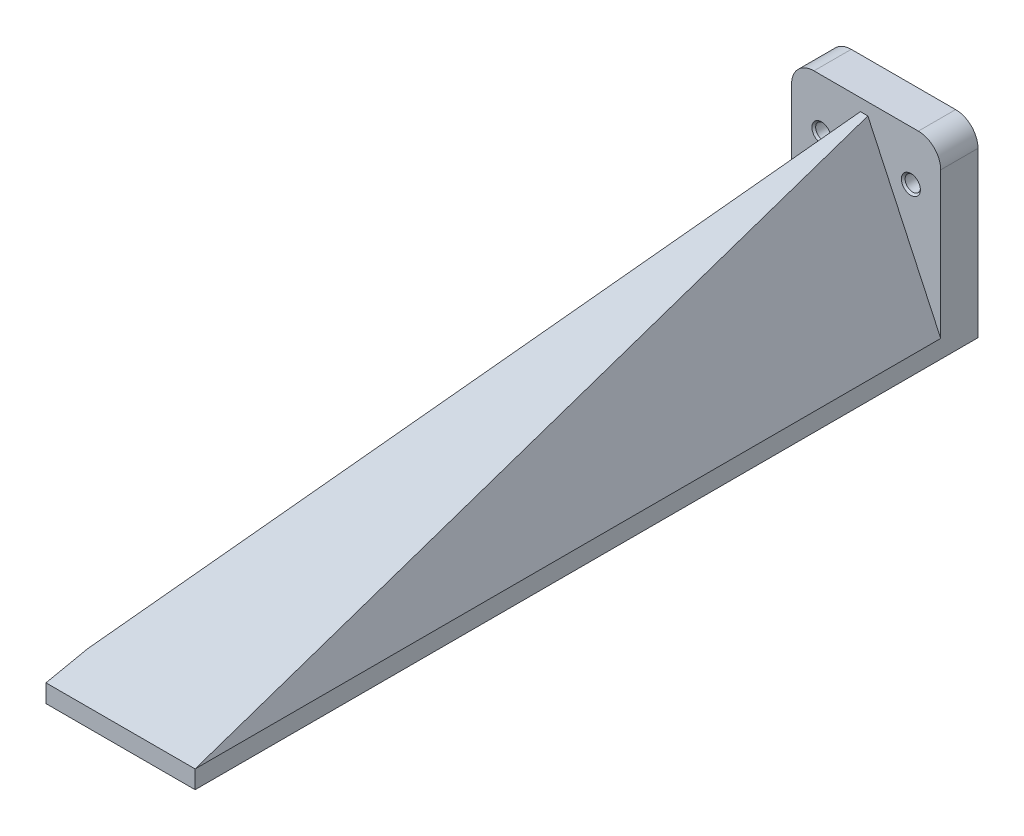
ISO-10303-21;
HEADER;
FILE_DESCRIPTION(('STEP AP214'),'2;1');
FILE_NAME('part.step','',(''),(''),'','','');
FILE_SCHEMA(('AUTOMOTIVE_DESIGN { 1 0 10303 214 1 1 1 1 }'));
ENDSEC;
DATA;
#1=APPLICATION_CONTEXT('core data for automotive mechanical design processes');
#2=APPLICATION_PROTOCOL_DEFINITION('international standard','automotive_design',2000,#1);
#3=PRODUCT_CONTEXT('',#1,'mechanical');
#4=PRODUCT('Part','Part','',(#3));
#5=PRODUCT_RELATED_PRODUCT_CATEGORY('part','',(#4));
#6=PRODUCT_DEFINITION_FORMATION('','',#4);
#7=PRODUCT_DEFINITION_CONTEXT('part definition',#1,'design');
#8=PRODUCT_DEFINITION('design','',#6,#7);
#9=PRODUCT_DEFINITION_SHAPE('','',#8);
#10=(LENGTH_UNIT() NAMED_UNIT(*) SI_UNIT(.MILLI.,.METRE.));
#11=(NAMED_UNIT(*) PLANE_ANGLE_UNIT() SI_UNIT($,.RADIAN.));
#12=(NAMED_UNIT(*) SI_UNIT($,.STERADIAN.) SOLID_ANGLE_UNIT());
#13=UNCERTAINTY_MEASURE_WITH_UNIT(LENGTH_MEASURE(1.E-05),#10,'distance_accuracy_value','');
#14=(GEOMETRIC_REPRESENTATION_CONTEXT(3) GLOBAL_UNCERTAINTY_ASSIGNED_CONTEXT((#13)) GLOBAL_UNIT_ASSIGNED_CONTEXT((#10,
#11,#12)) REPRESENTATION_CONTEXT('',''));
#15=CARTESIAN_POINT('',(0.,0.,0.));
#16=DIRECTION('',(0.,0.,1.));
#17=DIRECTION('',(1.,0.,0.));
#18=AXIS2_PLACEMENT_3D('',#15,#16,#17);
#19=CARTESIAN_POINT('',(0.,0.,5.));
#20=DIRECTION('',(0.,1.,0.));
#21=DIRECTION('',(0.,0.,1.));
#22=AXIS2_PLACEMENT_3D('',#19,#20,#21);
#23=PLANE('',#22);
#24=DIRECTION('',(1.,0.,0.));
#25=VECTOR('',#24,1.);
#26=CARTESIAN_POINT('',(0.,0.,0.));
#27=LINE('',#26,#25);
#28=CARTESIAN_POINT('',(0.,0.,0.));
#29=VERTEX_POINT('',#28);
#30=CARTESIAN_POINT('',(20.,0.,0.));
#31=VERTEX_POINT('',#30);
#32=EDGE_CURVE('E292',#29,#31,#27,.T.);
#33=ORIENTED_EDGE('',*,*,#32,.T.);
#34=DIRECTION('',(0.,0.,-1.));
#35=VECTOR('',#34,1.);
#36=CARTESIAN_POINT('',(20.,0.,5.));
#37=LINE('',#36,#35);
#38=CARTESIAN_POINT('',(20.,0.,105.));
#39=VERTEX_POINT('',#38);
#40=EDGE_CURVE('E289',#39,#31,#37,.T.);
#41=ORIENTED_EDGE('',*,*,#40,.F.);
#42=DIRECTION('',(1.,0.,0.));
#43=VECTOR('',#42,1.);
#44=CARTESIAN_POINT('',(20.,0.,105.));
#45=LINE('',#44,#43);
#46=CARTESIAN_POINT('',(0.,0.,105.));
#47=VERTEX_POINT('',#46);
#48=EDGE_CURVE('E248',#47,#39,#45,.T.);
#49=ORIENTED_EDGE('',*,*,#48,.F.);
#50=DIRECTION('',(0.,0.,-1.));
#51=VECTOR('',#50,1.);
#52=CARTESIAN_POINT('',(0.,0.,5.));
#53=LINE('',#52,#51);
#54=EDGE_CURVE('E304',#47,#29,#53,.T.);
#55=ORIENTED_EDGE('',*,*,#54,.T.);
#56=EDGE_LOOP('',(#33,#41,#49,#55));
#57=FACE_BOUND('',#56,.T.);
#58=DIRECTION('',(1.,0.,0.));
#59=VECTOR('',#58,1.);
#60=CARTESIAN_POINT('',(0.,0.,2.5));
#61=LINE('',#60,#59);
#62=CARTESIAN_POINT('',(2.5,0.,2.5));
#63=VERTEX_POINT('',#62);
#64=CARTESIAN_POINT('',(17.5,0.,2.5));
#65=VERTEX_POINT('',#64);
#66=EDGE_CURVE('E183',#63,#65,#61,.T.);
#67=ORIENTED_EDGE('',*,*,#66,.F.);
#68=DIRECTION('',(0.,0.,-1.));
#69=VECTOR('',#68,1.);
#70=CARTESIAN_POINT('',(2.5,0.,5.));
#71=LINE('',#70,#69);
#72=CARTESIAN_POINT('',(2.5,0.,102.5));
#73=VERTEX_POINT('',#72);
#74=EDGE_CURVE('E180',#73,#63,#71,.T.);
#75=ORIENTED_EDGE('',*,*,#74,.F.);
#76=DIRECTION('',(1.,0.,0.));
#77=VECTOR('',#76,1.);
#78=CARTESIAN_POINT('',(0.,0.,102.5));
#79=LINE('',#78,#77);
#80=CARTESIAN_POINT('',(17.5,0.,102.5));
#81=VERTEX_POINT('',#80);
#82=EDGE_CURVE('E65',#73,#81,#79,.T.);
#83=ORIENTED_EDGE('',*,*,#82,.T.);
#84=DIRECTION('',(0.,0.,-1.));
#85=VECTOR('',#84,1.);
#86=CARTESIAN_POINT('',(17.5,0.,5.));
#87=LINE('',#86,#85);
#88=EDGE_CURVE('E204',#81,#65,#87,.T.);
#89=ORIENTED_EDGE('',*,*,#88,.T.);
#90=EDGE_LOOP('',(#67,#75,#83,#89));
#91=FACE_BOUND('',#90,.T.);
#92=ADVANCED_FACE('F49',(#57,#91),#23,.F.);
#93=CARTESIAN_POINT('',(0.,0.,5.));
#94=DIRECTION('',(0.,0.,-1.));
#95=DIRECTION('',(-1.,0.,0.));
#96=AXIS2_PLACEMENT_3D('',#93,#94,#95);
#97=PLANE('',#96);
#98=CARTESIAN_POINT('',(16.,18.3071806822967,5.));
#99=DIRECTION('',(0.,0.,1.));
#100=DIRECTION('',(1.,0.,0.));
#101=AXIS2_PLACEMENT_3D('',#98,#99,#100);
#102=CIRCLE('',#101,1.275);
#103=CARTESIAN_POINT('',(17.275,18.3071806822967,5.));
#104=VERTEX_POINT('',#103);
#105=EDGE_CURVE('E444',#104,#104,#102,.T.);
#106=ORIENTED_EDGE('',*,*,#105,.F.);
#107=EDGE_LOOP('',(#106));
#108=FACE_BOUND('',#107,.T.);
#109=CARTESIAN_POINT('',(4.,18.3071806822967,5.));
#110=DIRECTION('',(0.,0.,1.));
#111=DIRECTION('',(1.,0.,0.));
#112=AXIS2_PLACEMENT_3D('',#109,#110,#111);
#113=CIRCLE('',#112,1.275);
#114=CARTESIAN_POINT('',(5.275,18.3071806822967,5.));
#115=VERTEX_POINT('',#114);
#116=EDGE_CURVE('E454',#115,#115,#113,.T.);
#117=ORIENTED_EDGE('',*,*,#116,.F.);
#118=EDGE_LOOP('',(#117));
#119=FACE_BOUND('',#118,.T.);
#120=DIRECTION('',(-1.,0.,0.));
#121=VECTOR('',#120,1.);
#122=CARTESIAN_POINT('',(0.,25.,5.));
#123=LINE('',#122,#121);
#124=CARTESIAN_POINT('',(17.,25.,5.));
#125=VERTEX_POINT('',#124);
#126=CARTESIAN_POINT('',(3.,25.,5.));
#127=VERTEX_POINT('',#126);
#128=EDGE_CURVE('E285',#125,#127,#123,.T.);
#129=ORIENTED_EDGE('',*,*,#128,.T.);
#130=CARTESIAN_POINT('',(3.,22.,5.));
#131=DIRECTION('',(0.,0.,-1.));
#132=DIRECTION('',(-1.,0.,0.));
#133=AXIS2_PLACEMENT_3D('',#130,#131,#132);
#134=CIRCLE('',#133,3.);
#135=CARTESIAN_POINT('',(0.,22.,5.));
#136=VERTEX_POINT('',#135);
#137=EDGE_CURVE('E58',#127,#136,#134,.F.);
#138=ORIENTED_EDGE('',*,*,#137,.T.);
#139=DIRECTION('',(0.,-1.,0.));
#140=VECTOR('',#139,1.);
#141=CARTESIAN_POINT('',(0.,0.,5.));
#142=LINE('',#141,#140);
#143=CARTESIAN_POINT('',(0.,3.58738047296451,5.));
#144=VERTEX_POINT('',#143);
#145=EDGE_CURVE('E278',#136,#144,#142,.T.);
#146=ORIENTED_EDGE('',*,*,#145,.T.);
#147=DIRECTION('',(-0.4226182617407,-0.90630778703665,0.));
#148=VECTOR('',#147,1.);
#149=CARTESIAN_POINT('',(0.,3.58738047296451,5.));
#150=LINE('',#149,#148);
#151=CARTESIAN_POINT('',(9.2274155237379,23.3756369220377,4.99999999999998));
#152=VERTEX_POINT('',#151);
#153=EDGE_CURVE('E253',#152,#144,#150,.T.);
#154=ORIENTED_EDGE('',*,*,#153,.F.);
#155=DIRECTION('',(-1.,0.,0.));
#156=VECTOR('',#155,1.);
#157=CARTESIAN_POINT('',(9.22741552373789,23.3756369220377,5.));
#158=LINE('',#157,#156);
#159=CARTESIAN_POINT('',(10.2274155237379,23.3756369220377,5.));
#160=VERTEX_POINT('',#159);
#161=EDGE_CURVE('E264',#160,#152,#158,.T.);
#162=ORIENTED_EDGE('',*,*,#161,.F.);
#163=DIRECTION('',(-0.422618261740701,0.906307787036649,0.));
#164=VECTOR('',#163,1.);
#165=CARTESIAN_POINT('',(10.2274155237379,23.3756369220377,5.));
#166=LINE('',#165,#164);
#167=CARTESIAN_POINT('',(20.,2.41826188142938,5.));
#168=VERTEX_POINT('',#167);
#169=EDGE_CURVE('E247',#168,#160,#166,.T.);
#170=ORIENTED_EDGE('',*,*,#169,.F.);
#171=DIRECTION('',(0.,1.,0.));
#172=VECTOR('',#171,1.);
#173=CARTESIAN_POINT('',(20.,0.,5.));
#174=LINE('',#173,#172);
#175=CARTESIAN_POINT('',(20.,22.,5.));
#176=VERTEX_POINT('',#175);
#177=EDGE_CURVE('E281',#168,#176,#174,.T.);
#178=ORIENTED_EDGE('',*,*,#177,.T.);
#179=CARTESIAN_POINT('',(17.,22.,5.));
#180=DIRECTION('',(0.,0.,-1.));
#181=DIRECTION('',(-1.,0.,0.));
#182=AXIS2_PLACEMENT_3D('',#179,#180,#181);
#183=CIRCLE('',#182,3.);
#184=EDGE_CURVE('E325',#176,#125,#183,.F.);
#185=ORIENTED_EDGE('',*,*,#184,.T.);
#186=EDGE_LOOP('',(#129,#138,#146,#154,#162,#170,#178,#185));
#187=FACE_BOUND('',#186,.T.);
#188=ADVANCED_FACE('F331',(#108,#119,#187),#97,.F.);
#189=CARTESIAN_POINT('',(0.,0.,5.));
#190=DIRECTION('',(1.,0.,0.));
#191=DIRECTION('',(0.,0.,-1.));
#192=AXIS2_PLACEMENT_3D('',#189,#190,#191);
#193=PLANE('',#192);
#194=ORIENTED_EDGE('',*,*,#145,.F.);
#195=DIRECTION('',(0.,0.,-1.));
#196=VECTOR('',#195,1.);
#197=CARTESIAN_POINT('',(0.,22.,5.));
#198=LINE('',#197,#196);
#199=CARTESIAN_POINT('',(0.,22.,0.));
#200=VERTEX_POINT('',#199);
#201=EDGE_CURVE('E308',#136,#200,#198,.T.);
#202=ORIENTED_EDGE('',*,*,#201,.T.);
#203=DIRECTION('',(0.,-1.,0.));
#204=VECTOR('',#203,1.);
#205=CARTESIAN_POINT('',(0.,0.,0.));
#206=LINE('',#205,#204);
#207=EDGE_CURVE('E277',#200,#29,#206,.T.);
#208=ORIENTED_EDGE('',*,*,#207,.T.);
#209=ORIENTED_EDGE('',*,*,#54,.F.);
#210=DIRECTION('',(0.,-1.,0.));
#211=VECTOR('',#210,1.);
#212=CARTESIAN_POINT('',(0.,0.,105.));
#213=LINE('',#212,#211);
#214=CARTESIAN_POINT('',(0.,2.41826188142944,105.));
#215=VERTEX_POINT('',#214);
#216=EDGE_CURVE('E257',#215,#47,#213,.T.);
#217=ORIENTED_EDGE('',*,*,#216,.F.);
#218=DIRECTION('',(0.,0.205117651611007,-0.978737323799182));
#219=VECTOR('',#218,1.);
#220=CARTESIAN_POINT('',(0.,2.41826188142944,105.));
#221=LINE('',#220,#219);
#222=CARTESIAN_POINT('',(0.,3.58738047296451,99.4214454850872));
#223=VERTEX_POINT('',#222);
#224=EDGE_CURVE('E172',#215,#223,#221,.T.);
#225=ORIENTED_EDGE('',*,*,#224,.T.);
#226=DIRECTION('',(0.,0.,-1.));
#227=VECTOR('',#226,1.);
#228=CARTESIAN_POINT('',(0.,3.58738047296451,105.));
#229=LINE('',#228,#227);
#230=EDGE_CURVE('E260',#223,#144,#229,.T.);
#231=ORIENTED_EDGE('',*,*,#230,.T.);
#232=EDGE_LOOP('',(#194,#202,#208,#209,#217,#225,#231));
#233=FACE_BOUND('',#232,.T.);
#234=ADVANCED_FACE('F338',(#233),#193,.F.);
#235=CARTESIAN_POINT('',(20.,0.,5.));
#236=DIRECTION('',(-1.,0.,0.));
#237=DIRECTION('',(0.,0.,1.));
#238=AXIS2_PLACEMENT_3D('',#235,#236,#237);
#239=PLANE('',#238);
#240=DIRECTION('',(0.,1.,0.));
#241=VECTOR('',#240,1.);
#242=CARTESIAN_POINT('',(20.,0.,0.));
#243=LINE('',#242,#241);
#244=CARTESIAN_POINT('',(20.,22.,0.));
#245=VERTEX_POINT('',#244);
#246=EDGE_CURVE('E295',#31,#245,#243,.T.);
#247=ORIENTED_EDGE('',*,*,#246,.T.);
#248=DIRECTION('',(0.,0.,-1.));
#249=VECTOR('',#248,1.);
#250=CARTESIAN_POINT('',(20.,22.,5.));
#251=LINE('',#250,#249);
#252=EDGE_CURVE('E11',#245,#176,#251,.F.);
#253=ORIENTED_EDGE('',*,*,#252,.T.);
#254=ORIENTED_EDGE('',*,*,#177,.F.);
#255=DIRECTION('',(0.,0.,-1.));
#256=VECTOR('',#255,1.);
#257=CARTESIAN_POINT('',(20.,2.41826188142944,105.));
#258=LINE('',#257,#256);
#259=CARTESIAN_POINT('',(20.,2.41826188142944,105.));
#260=VERTEX_POINT('',#259);
#261=EDGE_CURVE('E273',#260,#168,#258,.T.);
#262=ORIENTED_EDGE('',*,*,#261,.F.);
#263=DIRECTION('',(0.,1.,0.));
#264=VECTOR('',#263,1.);
#265=CARTESIAN_POINT('',(20.,2.41826188142944,105.));
#266=LINE('',#265,#264);
#267=EDGE_CURVE('E252',#39,#260,#266,.T.);
#268=ORIENTED_EDGE('',*,*,#267,.F.);
#269=ORIENTED_EDGE('',*,*,#40,.T.);
#270=EDGE_LOOP('',(#247,#253,#254,#262,#268,#269));
#271=FACE_BOUND('',#270,.T.);
#272=ADVANCED_FACE('F352',(#271),#239,.F.);
#273=CARTESIAN_POINT('',(0.,25.,5.));
#274=DIRECTION('',(0.,-1.,0.));
#275=DIRECTION('',(0.,0.,-1.));
#276=AXIS2_PLACEMENT_3D('',#273,#274,#275);
#277=PLANE('',#276);
#278=DIRECTION('',(-1.,0.,0.));
#279=VECTOR('',#278,1.);
#280=CARTESIAN_POINT('',(0.,25.,0.));
#281=LINE('',#280,#279);
#282=CARTESIAN_POINT('',(17.,25.,0.));
#283=VERTEX_POINT('',#282);
#284=CARTESIAN_POINT('',(3.,25.,0.));
#285=VERTEX_POINT('',#284);
#286=EDGE_CURVE('E282',#283,#285,#281,.T.);
#287=ORIENTED_EDGE('',*,*,#286,.T.);
#288=DIRECTION('',(0.,0.,-1.));
#289=VECTOR('',#288,1.);
#290=CARTESIAN_POINT('',(3.,25.,5.));
#291=LINE('',#290,#289);
#292=EDGE_CURVE('E322',#285,#127,#291,.F.);
#293=ORIENTED_EDGE('',*,*,#292,.T.);
#294=ORIENTED_EDGE('',*,*,#128,.F.);
#295=DIRECTION('',(0.,0.,-1.));
#296=VECTOR('',#295,1.);
#297=CARTESIAN_POINT('',(17.,25.,5.));
#298=LINE('',#297,#296);
#299=EDGE_CURVE('E318',#125,#283,#298,.T.);
#300=ORIENTED_EDGE('',*,*,#299,.T.);
#301=EDGE_LOOP('',(#287,#293,#294,#300));
#302=FACE_BOUND('',#301,.T.);
#303=ADVANCED_FACE('F347',(#302),#277,.F.);
#304=CARTESIAN_POINT('',(0.,0.,0.));
#305=DIRECTION('',(0.,0.,-1.));
#306=DIRECTION('',(-1.,0.,0.));
#307=AXIS2_PLACEMENT_3D('',#304,#305,#306);
#308=PLANE('',#307);
#309=CARTESIAN_POINT('',(16.,18.3071806822967,0.));
#310=DIRECTION('',(0.,0.,1.));
#311=DIRECTION('',(1.,0.,0.));
#312=AXIS2_PLACEMENT_3D('',#309,#310,#311);
#313=CIRCLE('',#312,1.025);
#314=CARTESIAN_POINT('',(17.025,18.3071806822967,0.));
#315=VERTEX_POINT('',#314);
#316=EDGE_CURVE('E448',#315,#315,#313,.T.);
#317=ORIENTED_EDGE('',*,*,#316,.T.);
#318=EDGE_LOOP('',(#317));
#319=FACE_BOUND('',#318,.T.);
#320=CARTESIAN_POINT('',(4.,18.3071806822967,0.));
#321=DIRECTION('',(0.,0.,1.));
#322=DIRECTION('',(1.,0.,0.));
#323=AXIS2_PLACEMENT_3D('',#320,#321,#322);
#324=CIRCLE('',#323,1.025);
#325=CARTESIAN_POINT('',(5.025,18.3071806822967,0.));
#326=VERTEX_POINT('',#325);
#327=EDGE_CURVE('E462',#326,#326,#324,.T.);
#328=ORIENTED_EDGE('',*,*,#327,.T.);
#329=EDGE_LOOP('',(#328));
#330=FACE_BOUND('',#329,.T.);
#331=ORIENTED_EDGE('',*,*,#207,.F.);
#332=CARTESIAN_POINT('',(3.,22.,0.));
#333=DIRECTION('',(0.,0.,-1.));
#334=DIRECTION('',(-1.,0.,0.));
#335=AXIS2_PLACEMENT_3D('',#332,#333,#334);
#336=CIRCLE('',#335,3.);
#337=EDGE_CURVE('E315',#200,#285,#336,.T.);
#338=ORIENTED_EDGE('',*,*,#337,.T.);
#339=ORIENTED_EDGE('',*,*,#286,.F.);
#340=CARTESIAN_POINT('',(17.,22.,0.));
#341=DIRECTION('',(0.,0.,-1.));
#342=DIRECTION('',(-1.,0.,0.));
#343=AXIS2_PLACEMENT_3D('',#340,#341,#342);
#344=CIRCLE('',#343,3.);
#345=EDGE_CURVE('E312',#283,#245,#344,.T.);
#346=ORIENTED_EDGE('',*,*,#345,.T.);
#347=ORIENTED_EDGE('',*,*,#246,.F.);
#348=ORIENTED_EDGE('',*,*,#32,.F.);
#349=EDGE_LOOP('',(#331,#338,#339,#346,#347,#348));
#350=FACE_BOUND('',#349,.T.);
#351=ADVANCED_FACE('F344',(#319,#330,#350),#308,.T.);
#352=CARTESIAN_POINT('',(10.2274155237379,23.3756369220377,105.));
#353=DIRECTION('',(-0.906307787036649,-0.422618261740701,0.));
#354=DIRECTION('',(0.422618261740701,-0.906307787036649,0.));
#355=AXIS2_PLACEMENT_3D('',#352,#353,#354);
#356=PLANE('',#355);
#357=ORIENTED_EDGE('',*,*,#169,.T.);
#358=DIRECTION('',(0.0952133922177726,-0.204185778536203,0.974290807606204));
#359=VECTOR('',#358,1.);
#360=CARTESIAN_POINT('',(19.5039688036159,3.48200421486381,99.9242577785949));
#361=LINE('',#360,#359);
#362=EDGE_CURVE('E243',#160,#260,#361,.T.);
#363=ORIENTED_EDGE('',*,*,#362,.T.);
#364=ORIENTED_EDGE('',*,*,#261,.T.);
#365=EDGE_LOOP('',(#357,#363,#364));
#366=FACE_BOUND('',#365,.T.);
#367=ADVANCED_FACE('F367',(#366),#356,.F.);
#368=CARTESIAN_POINT('',(0.,3.58738047296451,105.));
#369=DIRECTION('',(0.90630778703665,-0.4226182617407,0.));
#370=DIRECTION('',(0.4226182617407,0.90630778703665,0.));
#371=AXIS2_PLACEMENT_3D('',#368,#369,#370);
#372=PLANE('',#371);
#373=ORIENTED_EDGE('',*,*,#230,.F.);
#374=DIRECTION('',(0.0952133922177724,0.204185778536203,-0.974290807606204));
#375=VECTOR('',#374,1.);
#376=CARTESIAN_POINT('',(-0.517497581822926,2.47760332739828,104.716846953142));
#377=LINE('',#376,#375);
#378=EDGE_CURVE('E239',#223,#152,#377,.T.);
#379=ORIENTED_EDGE('',*,*,#378,.T.);
#380=ORIENTED_EDGE('',*,*,#153,.T.);
#381=EDGE_LOOP('',(#373,#379,#380));
#382=FACE_BOUND('',#381,.T.);
#383=ADVANCED_FACE('F369',(#382),#372,.F.);
#384=CARTESIAN_POINT('',(0.,0.,105.));
#385=DIRECTION('',(0.,0.,-1.));
#386=DIRECTION('',(-1.,0.,0.));
#387=AXIS2_PLACEMENT_3D('',#384,#385,#386);
#388=PLANE('',#387);
#389=ORIENTED_EDGE('',*,*,#267,.T.);
#390=DIRECTION('',(1.,0.,0.));
#391=VECTOR('',#390,1.);
#392=CARTESIAN_POINT('',(0.,2.41826188142944,105.));
#393=LINE('',#392,#391);
#394=EDGE_CURVE('E236',#215,#260,#393,.T.);
#395=ORIENTED_EDGE('',*,*,#394,.F.);
#396=ORIENTED_EDGE('',*,*,#216,.T.);
#397=ORIENTED_EDGE('',*,*,#48,.T.);
#398=EDGE_LOOP('',(#389,#395,#396,#397));
#399=FACE_BOUND('',#398,.T.);
#400=ADVANCED_FACE('F362',(#399),#388,.F.);
#401=CARTESIAN_POINT('',(0.,2.41826188142944,105.));
#402=DIRECTION('',(0.,-0.978737323799182,-0.205117651611007));
#403=DIRECTION('',(0.,0.205117651611007,-0.978737323799182));
#404=AXIS2_PLACEMENT_3D('',#401,#402,#403);
#405=PLANE('',#404);
#406=ORIENTED_EDGE('',*,*,#161,.T.);
#407=ORIENTED_EDGE('',*,*,#378,.F.);
#408=ORIENTED_EDGE('',*,*,#224,.F.);
#409=ORIENTED_EDGE('',*,*,#394,.T.);
#410=ORIENTED_EDGE('',*,*,#362,.F.);
#411=EDGE_LOOP('',(#406,#407,#408,#409,#410));
#412=FACE_BOUND('',#411,.T.);
#413=ADVANCED_FACE('F364',(#412),#405,.F.);
#414=CARTESIAN_POINT('',(3.,22.,5.));
#415=DIRECTION('',(0.,0.,-1.));
#416=DIRECTION('',(-1.,0.,0.));
#417=AXIS2_PLACEMENT_3D('',#414,#415,#416);
#418=CYLINDRICAL_SURFACE('',#417,3.);
#419=ORIENTED_EDGE('',*,*,#137,.F.);
#420=ORIENTED_EDGE('',*,*,#292,.F.);
#421=ORIENTED_EDGE('',*,*,#337,.F.);
#422=ORIENTED_EDGE('',*,*,#201,.F.);
#423=EDGE_LOOP('',(#419,#420,#421,#422));
#424=FACE_BOUND('',#423,.T.);
#425=ADVANCED_FACE('F341',(#424),#418,.T.);
#426=CARTESIAN_POINT('',(17.,22.,5.));
#427=DIRECTION('',(0.,0.,-1.));
#428=DIRECTION('',(-1.,0.,0.));
#429=AXIS2_PLACEMENT_3D('',#426,#427,#428);
#430=CYLINDRICAL_SURFACE('',#429,3.);
#431=ORIENTED_EDGE('',*,*,#184,.F.);
#432=ORIENTED_EDGE('',*,*,#252,.F.);
#433=ORIENTED_EDGE('',*,*,#345,.F.);
#434=ORIENTED_EDGE('',*,*,#299,.F.);
#435=EDGE_LOOP('',(#431,#432,#433,#434));
#436=FACE_BOUND('',#435,.T.);
#437=ADVANCED_FACE('F51',(#436),#430,.T.);
#438=CARTESIAN_POINT('',(2.5,0.,5.));
#439=DIRECTION('',(1.,0.,0.));
#440=DIRECTION('',(0.,0.,-1.));
#441=AXIS2_PLACEMENT_3D('',#438,#439,#440);
#442=PLANE('',#441);
#443=DIRECTION('',(0.,0.,-1.));
#444=VECTOR('',#443,1.);
#445=CARTESIAN_POINT('',(2.5,3.03314381635716,5.));
#446=LINE('',#445,#444);
#447=CARTESIAN_POINT('',(2.5,3.03314381635716,89.8779084828545));
#448=VERTEX_POINT('',#447);
#449=CARTESIAN_POINT('',(2.5,3.03314381635716,2.5));
#450=VERTEX_POINT('',#449);
#451=EDGE_CURVE('E178',#448,#450,#446,.T.);
#452=ORIENTED_EDGE('',*,*,#451,.F.);
#453=DIRECTION('',(0.,0.205117651611007,-0.978737323799182));
#454=VECTOR('',#453,1.);
#455=CARTESIAN_POINT('',(2.5,19.9453045729776,9.1800122823505));
#456=LINE('',#455,#454);
#457=CARTESIAN_POINT('',(2.5,0.387884759140175,102.5));
#458=VERTEX_POINT('',#457);
#459=EDGE_CURVE('E201',#458,#448,#456,.T.);
#460=ORIENTED_EDGE('',*,*,#459,.F.);
#461=DIRECTION('',(0.,-1.,0.));
#462=VECTOR('',#461,1.);
#463=CARTESIAN_POINT('',(2.5,0.,102.5));
#464=LINE('',#463,#462);
#465=EDGE_CURVE('E191',#458,#73,#464,.T.);
#466=ORIENTED_EDGE('',*,*,#465,.T.);
#467=ORIENTED_EDGE('',*,*,#74,.T.);
#468=DIRECTION('',(0.,-1.,0.));
#469=VECTOR('',#468,1.);
#470=CARTESIAN_POINT('',(2.5,0.,2.5));
#471=LINE('',#470,#469);
#472=EDGE_CURVE('E165',#450,#63,#471,.T.);
#473=ORIENTED_EDGE('',*,*,#472,.F.);
#474=EDGE_LOOP('',(#452,#460,#466,#467,#473));
#475=FACE_BOUND('',#474,.T.);
#476=ADVANCED_FACE('F177',(#475),#442,.T.);
#477=CARTESIAN_POINT('',(17.5,0.,5.));
#478=DIRECTION('',(-1.,0.,0.));
#479=DIRECTION('',(0.,0.,1.));
#480=AXIS2_PLACEMENT_3D('',#477,#478,#479);
#481=PLANE('',#480);
#482=DIRECTION('',(0.,1.,0.));
#483=VECTOR('',#482,1.);
#484=CARTESIAN_POINT('',(17.5,0.,2.5));
#485=LINE('',#484,#483);
#486=CARTESIAN_POINT('',(17.5,1.86402522482209,2.5));
#487=VERTEX_POINT('',#486);
#488=EDGE_CURVE('E202',#65,#487,#485,.T.);
#489=ORIENTED_EDGE('',*,*,#488,.F.);
#490=ORIENTED_EDGE('',*,*,#88,.F.);
#491=DIRECTION('',(0.,1.,0.));
#492=VECTOR('',#491,1.);
#493=CARTESIAN_POINT('',(17.5,0.,102.5));
#494=LINE('',#493,#492);
#495=CARTESIAN_POINT('',(17.5,0.387884759140175,102.5));
#496=VERTEX_POINT('',#495);
#497=EDGE_CURVE('E197',#81,#496,#494,.T.);
#498=ORIENTED_EDGE('',*,*,#497,.T.);
#499=DIRECTION('',(0.,-0.205117651611007,0.978737323799182));
#500=VECTOR('',#499,1.);
#501=CARTESIAN_POINT('',(17.5,19.9453045729776,9.1800122823505));
#502=LINE('',#501,#500);
#503=CARTESIAN_POINT('',(17.5,1.86402522482209,95.4564629977673));
#504=VERTEX_POINT('',#503);
#505=EDGE_CURVE('E218',#504,#496,#502,.T.);
#506=ORIENTED_EDGE('',*,*,#505,.F.);
#507=DIRECTION('',(0.,0.,-1.));
#508=VECTOR('',#507,1.);
#509=CARTESIAN_POINT('',(17.5,1.86402522482209,105.));
#510=LINE('',#509,#508);
#511=EDGE_CURVE('E184',#504,#487,#510,.T.);
#512=ORIENTED_EDGE('',*,*,#511,.T.);
#513=EDGE_LOOP('',(#489,#490,#498,#506,#512));
#514=FACE_BOUND('',#513,.T.);
#515=ADVANCED_FACE('F416',(#514),#481,.T.);
#516=CARTESIAN_POINT('',(0.,0.,2.5));
#517=DIRECTION('',(0.,0.,-1.));
#518=DIRECTION('',(-1.,0.,0.));
#519=AXIS2_PLACEMENT_3D('',#516,#517,#518);
#520=PLANE('',#519);
#521=DIRECTION('',(-0.4226182617407,-0.90630778703665,0.));
#522=VECTOR('',#521,1.);
#523=CARTESIAN_POINT('',(0.891723029257626,-0.415817277496006,2.5));
#524=LINE('',#523,#522);
#525=CARTESIAN_POINT('',(9.7274155237379,18.5323864244113,2.5));
#526=VERTEX_POINT('',#525);
#527=EDGE_CURVE('E162',#526,#450,#524,.T.);
#528=ORIENTED_EDGE('',*,*,#527,.T.);
#529=ORIENTED_EDGE('',*,*,#472,.T.);
#530=ORIENTED_EDGE('',*,*,#66,.T.);
#531=ORIENTED_EDGE('',*,*,#488,.T.);
#532=DIRECTION('',(-0.422618261740701,0.906307787036649,0.));
#533=VECTOR('',#532,1.);
#534=CARTESIAN_POINT('',(15.0883546674115,7.03581533037273,2.5));
#535=LINE('',#534,#533);
#536=EDGE_CURVE('E168',#487,#526,#535,.T.);
#537=ORIENTED_EDGE('',*,*,#536,.T.);
#538=EDGE_LOOP('',(#528,#529,#530,#531,#537));
#539=FACE_BOUND('',#538,.T.);
#540=ADVANCED_FACE('F164',(#539),#520,.F.);
#541=CARTESIAN_POINT('',(7.96164605614627,22.319091267686,105.));
#542=DIRECTION('',(-0.906307787036649,-0.422618261740701,0.));
#543=DIRECTION('',(0.422618261740701,-0.906307787036649,0.));
#544=AXIS2_PLACEMENT_3D('',#541,#542,#543);
#545=PLANE('',#544);
#546=DIRECTION('',(0.,0.,-1.));
#547=VECTOR('',#546,1.);
#548=CARTESIAN_POINT('',(9.7274155237379,18.5323864244113,105.));
#549=LINE('',#548,#547);
#550=CARTESIAN_POINT('',(9.7274155237379,18.5323864244113,15.921878311987));
#551=VERTEX_POINT('',#550);
#552=EDGE_CURVE('E173',#551,#526,#549,.T.);
#553=ORIENTED_EDGE('',*,*,#552,.T.);
#554=ORIENTED_EDGE('',*,*,#536,.F.);
#555=ORIENTED_EDGE('',*,*,#511,.F.);
#556=DIRECTION('',(0.0952133922177726,-0.204185778536203,0.974290807606204));
#557=VECTOR('',#556,1.);
#558=CARTESIAN_POINT('',(17.9011690364417,1.00371544987862,99.5615084687601));
#559=LINE('',#558,#557);
#560=EDGE_CURVE('E209',#551,#504,#559,.T.);
#561=ORIENTED_EDGE('',*,*,#560,.F.);
#562=EDGE_LOOP('',(#553,#554,#555,#561));
#563=FACE_BOUND('',#562,.T.);
#564=ADVANCED_FACE('F410',(#563),#545,.T.);
#565=CARTESIAN_POINT('',(2.26576946759162,2.53083481861276,105.));
#566=DIRECTION('',(0.90630778703665,-0.4226182617407,0.));
#567=DIRECTION('',(0.4226182617407,0.90630778703665,0.));
#568=AXIS2_PLACEMENT_3D('',#565,#566,#567);
#569=PLANE('',#568);
#570=DIRECTION('',(0.0952133922177724,0.204185778536203,-0.974290807606204));
#571=VECTOR('',#570,1.);
#572=CARTESIAN_POINT('',(1.08530218535122,-0.000685437586897542,104.354097643308));
#573=LINE('',#572,#571);
#574=EDGE_CURVE('E188',#448,#551,#573,.T.);
#575=ORIENTED_EDGE('',*,*,#574,.F.);
#576=ORIENTED_EDGE('',*,*,#451,.T.);
#577=ORIENTED_EDGE('',*,*,#527,.F.);
#578=ORIENTED_EDGE('',*,*,#552,.F.);
#579=EDGE_LOOP('',(#575,#576,#577,#578));
#580=FACE_BOUND('',#579,.T.);
#581=ADVANCED_FACE('F186',(#580),#569,.T.);
#582=CARTESIAN_POINT('',(0.,0.,102.5));
#583=DIRECTION('',(0.,0.,-1.));
#584=DIRECTION('',(-1.,0.,0.));
#585=AXIS2_PLACEMENT_3D('',#582,#583,#584);
#586=PLANE('',#585);
#587=ORIENTED_EDGE('',*,*,#497,.F.);
#588=ORIENTED_EDGE('',*,*,#82,.F.);
#589=ORIENTED_EDGE('',*,*,#465,.F.);
#590=DIRECTION('',(1.,0.,0.));
#591=VECTOR('',#590,1.);
#592=CARTESIAN_POINT('',(0.,0.387884759140175,102.5));
#593=LINE('',#592,#591);
#594=EDGE_CURVE('E213',#458,#496,#593,.T.);
#595=ORIENTED_EDGE('',*,*,#594,.T.);
#596=EDGE_LOOP('',(#587,#588,#589,#595));
#597=FACE_BOUND('',#596,.T.);
#598=ADVANCED_FACE('F404',(#597),#586,.T.);
#599=CARTESIAN_POINT('',(0.,-0.0285814280685135,104.487205870972));
#600=DIRECTION('',(0.,-0.978737323799182,-0.205117651611007));
#601=DIRECTION('',(0.,0.205117651611007,-0.978737323799182));
#602=AXIS2_PLACEMENT_3D('',#599,#600,#601);
#603=PLANE('',#602);
#604=ORIENTED_EDGE('',*,*,#560,.T.);
#605=ORIENTED_EDGE('',*,*,#505,.T.);
#606=ORIENTED_EDGE('',*,*,#594,.F.);
#607=ORIENTED_EDGE('',*,*,#459,.T.);
#608=ORIENTED_EDGE('',*,*,#574,.T.);
#609=EDGE_LOOP('',(#604,#605,#606,#607,#608));
#610=FACE_BOUND('',#609,.T.);
#611=ADVANCED_FACE('F400',(#610),#603,.T.);
#612=CARTESIAN_POINT('',(4.,18.3071806822967,5.));
#613=DIRECTION('',(0.,0.,1.));
#614=DIRECTION('',(1.,0.,0.));
#615=AXIS2_PLACEMENT_3D('',#612,#613,#614);
#616=CYLINDRICAL_SURFACE('',#615,1.02499999999999);
#617=ORIENTED_EDGE('',*,*,#327,.F.);
#618=EDGE_LOOP('',(#617));
#619=FACE_BOUND('',#618,.T.);
#620=CARTESIAN_POINT('',(4.,18.3071806822967,4.74999999999999));
#621=DIRECTION('',(0.,0.,1.));
#622=DIRECTION('',(1.,0.,0.));
#623=AXIS2_PLACEMENT_3D('',#620,#621,#622);
#624=CIRCLE('',#623,1.02499999999999);
#625=CARTESIAN_POINT('',(5.02499999999999,18.3071806822967,4.74999999999999));
#626=VERTEX_POINT('',#625);
#627=EDGE_CURVE('E458',#626,#626,#624,.T.);
#628=ORIENTED_EDGE('',*,*,#627,.T.);
#629=EDGE_LOOP('',(#628));
#630=FACE_BOUND('',#629,.T.);
#631=ADVANCED_FACE('F403',(#619,#630),#616,.F.);
#632=CARTESIAN_POINT('',(4.,18.3071806822967,5.));
#633=DIRECTION('',(0.,0.,1.));
#634=DIRECTION('',(1.,0.,0.));
#635=AXIS2_PLACEMENT_3D('',#632,#633,#634);
#636=CONICAL_SURFACE('',#635,1.275,0.785398163397442);
#637=ORIENTED_EDGE('',*,*,#627,.F.);
#638=EDGE_LOOP('',(#637));
#639=FACE_BOUND('',#638,.T.);
#640=ORIENTED_EDGE('',*,*,#116,.T.);
#641=EDGE_LOOP('',(#640));
#642=FACE_BOUND('',#641,.T.);
#643=ADVANCED_FACE('F423',(#639,#642),#636,.F.);
#644=CARTESIAN_POINT('',(16.,18.3071806822967,5.));
#645=DIRECTION('',(0.,0.,1.));
#646=DIRECTION('',(1.,0.,0.));
#647=AXIS2_PLACEMENT_3D('',#644,#645,#646);
#648=CYLINDRICAL_SURFACE('',#647,1.02499999999999);
#649=ORIENTED_EDGE('',*,*,#316,.F.);
#650=EDGE_LOOP('',(#649));
#651=FACE_BOUND('',#650,.T.);
#652=CARTESIAN_POINT('',(16.,18.3071806822967,4.74999999999999));
#653=DIRECTION('',(0.,0.,1.));
#654=DIRECTION('',(1.,0.,0.));
#655=AXIS2_PLACEMENT_3D('',#652,#653,#654);
#656=CIRCLE('',#655,1.02499999999999);
#657=CARTESIAN_POINT('',(17.025,18.3071806822967,4.74999999999999));
#658=VERTEX_POINT('',#657);
#659=EDGE_CURVE('E441',#658,#658,#656,.T.);
#660=ORIENTED_EDGE('',*,*,#659,.T.);
#661=EDGE_LOOP('',(#660));
#662=FACE_BOUND('',#661,.T.);
#663=ADVANCED_FACE('F427',(#651,#662),#648,.F.);
#664=CARTESIAN_POINT('',(16.,18.3071806822967,5.));
#665=DIRECTION('',(0.,0.,1.));
#666=DIRECTION('',(1.,0.,0.));
#667=AXIS2_PLACEMENT_3D('',#664,#665,#666);
#668=CONICAL_SURFACE('',#667,1.275,0.785398163397445);
#669=ORIENTED_EDGE('',*,*,#659,.F.);
#670=EDGE_LOOP('',(#669));
#671=FACE_BOUND('',#670,.T.);
#672=ORIENTED_EDGE('',*,*,#105,.T.);
#673=EDGE_LOOP('',(#672));
#674=FACE_BOUND('',#673,.T.);
#675=ADVANCED_FACE('F431',(#671,#674),#668,.F.);
#676=CLOSED_SHELL('',(#92,#188,#234,#272,#303,#351,#367,#383,#400,#413,#425,#437,#476,#515,#540,
#564,#581,#598,#611,#631,#643,#663,#675));
#677=MANIFOLD_SOLID_BREP('B2',#676);
#678=ADVANCED_BREP_SHAPE_REPRESENTATION('',(#18,#677),#14);
#679=SHAPE_DEFINITION_REPRESENTATION(#9,#678);
ENDSEC;
END-ISO-10303-21;
